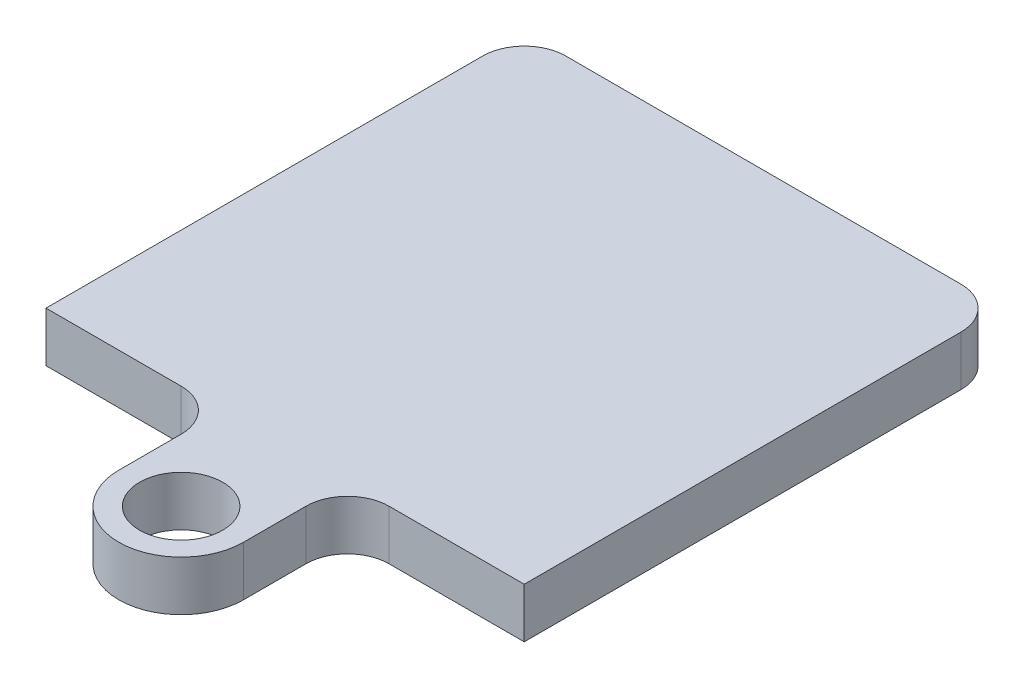
ISO-10303-21;
HEADER;
FILE_DESCRIPTION(('STEP AP214'),'2;1');
FILE_NAME('part.step','',(''),(''),'','','');
FILE_SCHEMA(('AUTOMOTIVE_DESIGN { 1 0 10303 214 1 1 1 1 }'));
ENDSEC;
DATA;
#1=APPLICATION_CONTEXT('core data for automotive mechanical design processes');
#2=APPLICATION_PROTOCOL_DEFINITION('international standard','automotive_design',2000,#1);
#3=PRODUCT_CONTEXT('',#1,'mechanical');
#4=PRODUCT('Part','Part','',(#3));
#5=PRODUCT_RELATED_PRODUCT_CATEGORY('part','',(#4));
#6=PRODUCT_DEFINITION_FORMATION('','',#4);
#7=PRODUCT_DEFINITION_CONTEXT('part definition',#1,'design');
#8=PRODUCT_DEFINITION('design','',#6,#7);
#9=PRODUCT_DEFINITION_SHAPE('','',#8);
#10=(LENGTH_UNIT() NAMED_UNIT(*) SI_UNIT(.MILLI.,.METRE.));
#11=(NAMED_UNIT(*) PLANE_ANGLE_UNIT() SI_UNIT($,.RADIAN.));
#12=(NAMED_UNIT(*) SI_UNIT($,.STERADIAN.) SOLID_ANGLE_UNIT());
#13=UNCERTAINTY_MEASURE_WITH_UNIT(LENGTH_MEASURE(1.E-05),#10,'distance_accuracy_value','');
#14=(GEOMETRIC_REPRESENTATION_CONTEXT(3) GLOBAL_UNCERTAINTY_ASSIGNED_CONTEXT((#13)) GLOBAL_UNIT_ASSIGNED_CONTEXT((#10,
#11,#12)) REPRESENTATION_CONTEXT('',''));
#15=CARTESIAN_POINT('',(0.,0.,0.));
#16=DIRECTION('',(0.,0.,1.));
#17=DIRECTION('',(1.,0.,0.));
#18=AXIS2_PLACEMENT_3D('',#15,#16,#17);
#19=CARTESIAN_POINT('',(-11.5,2.4,11.5));
#20=DIRECTION('',(0.,0.,-1.));
#21=DIRECTION('',(-1.,0.,0.));
#22=AXIS2_PLACEMENT_3D('',#19,#20,#21);
#23=PLANE('',#22);
#24=DIRECTION('',(1.,0.,0.));
#25=VECTOR('',#24,1.);
#26=CARTESIAN_POINT('',(-11.5,2.4,11.5));
#27=LINE('',#26,#25);
#28=CARTESIAN_POINT('',(5.,2.4,11.5));
#29=VERTEX_POINT('',#28);
#30=CARTESIAN_POINT('',(11.5,2.4,11.5));
#31=VERTEX_POINT('',#30);
#32=EDGE_CURVE('E157',#29,#31,#27,.T.);
#33=ORIENTED_EDGE('',*,*,#32,.F.);
#34=DIRECTION('',(0.,1.,0.));
#35=VECTOR('',#34,1.);
#36=CARTESIAN_POINT('',(5.,2.4,11.5));
#37=LINE('',#36,#35);
#38=CARTESIAN_POINT('',(5.,0.,11.5));
#39=VERTEX_POINT('',#38);
#40=EDGE_CURVE('E203',#29,#39,#37,.F.);
#41=ORIENTED_EDGE('',*,*,#40,.T.);
#42=DIRECTION('',(1.,0.,0.));
#43=VECTOR('',#42,1.);
#44=CARTESIAN_POINT('',(-11.5,0.,11.5));
#45=LINE('',#44,#43);
#46=CARTESIAN_POINT('',(11.5,0.,11.5));
#47=VERTEX_POINT('',#46);
#48=EDGE_CURVE('E168',#39,#47,#45,.T.);
#49=ORIENTED_EDGE('',*,*,#48,.T.);
#50=DIRECTION('',(0.,-1.,0.));
#51=VECTOR('',#50,1.);
#52=CARTESIAN_POINT('',(11.5,2.4,11.5));
#53=LINE('',#52,#51);
#54=EDGE_CURVE('E166',#31,#47,#53,.T.);
#55=ORIENTED_EDGE('',*,*,#54,.F.);
#56=EDGE_LOOP('',(#33,#41,#49,#55));
#57=FACE_BOUND('',#56,.T.);
#58=ADVANCED_FACE('F37',(#57),#23,.F.);
#59=CARTESIAN_POINT('',(-11.5,2.4,-11.5));
#60=DIRECTION('',(1.,0.,0.));
#61=DIRECTION('',(0.,0.,-1.));
#62=AXIS2_PLACEMENT_3D('',#59,#60,#61);
#63=PLANE('',#62);
#64=DIRECTION('',(0.,0.,1.));
#65=VECTOR('',#64,1.);
#66=CARTESIAN_POINT('',(-11.5,2.4,-11.5));
#67=LINE('',#66,#65);
#68=CARTESIAN_POINT('',(-11.5,2.4,-9.5));
#69=VERTEX_POINT('',#68);
#70=CARTESIAN_POINT('',(-11.5,2.4,11.5));
#71=VERTEX_POINT('',#70);
#72=EDGE_CURVE('E155',#69,#71,#67,.T.);
#73=ORIENTED_EDGE('',*,*,#72,.F.);
#74=DIRECTION('',(0.,-1.,0.));
#75=VECTOR('',#74,1.);
#76=CARTESIAN_POINT('',(-11.5,2.4,-9.5));
#77=LINE('',#76,#75);
#78=CARTESIAN_POINT('',(-11.5,0.,-9.5));
#79=VERTEX_POINT('',#78);
#80=EDGE_CURVE('E182',#69,#79,#77,.T.);
#81=ORIENTED_EDGE('',*,*,#80,.T.);
#82=DIRECTION('',(0.,0.,1.));
#83=VECTOR('',#82,1.);
#84=CARTESIAN_POINT('',(-11.5,0.,-11.5));
#85=LINE('',#84,#83);
#86=CARTESIAN_POINT('',(-11.5,0.,11.5));
#87=VERTEX_POINT('',#86);
#88=EDGE_CURVE('E154',#79,#87,#85,.T.);
#89=ORIENTED_EDGE('',*,*,#88,.T.);
#90=DIRECTION('',(0.,-1.,0.));
#91=VECTOR('',#90,1.);
#92=CARTESIAN_POINT('',(-11.5,2.4,11.5));
#93=LINE('',#92,#91);
#94=EDGE_CURVE('E179',#71,#87,#93,.T.);
#95=ORIENTED_EDGE('',*,*,#94,.F.);
#96=EDGE_LOOP('',(#73,#81,#89,#95));
#97=FACE_BOUND('',#96,.T.);
#98=ADVANCED_FACE('F251',(#97),#63,.F.);
#99=CARTESIAN_POINT('',(-5.,0.,11.5));
#100=VERTEX_POINT('',#99);
#101=EDGE_CURVE('E169',#87,#100,#45,.T.);
#102=ORIENTED_EDGE('',*,*,#101,.T.);
#103=DIRECTION('',(0.,1.,0.));
#104=VECTOR('',#103,1.);
#105=CARTESIAN_POINT('',(-5.,2.4,11.5));
#106=LINE('',#105,#104);
#107=CARTESIAN_POINT('',(-5.,2.4,11.5));
#108=VERTEX_POINT('',#107);
#109=EDGE_CURVE('E205',#100,#108,#106,.T.);
#110=ORIENTED_EDGE('',*,*,#109,.T.);
#111=EDGE_CURVE('E159',#71,#108,#27,.T.);
#112=ORIENTED_EDGE('',*,*,#111,.F.);
#113=ORIENTED_EDGE('',*,*,#94,.T.);
#114=EDGE_LOOP('',(#102,#110,#112,#113));
#115=FACE_BOUND('',#114,.T.);
#116=ADVANCED_FACE('F255',(#115),#23,.F.);
#117=CARTESIAN_POINT('',(11.5,2.4,-11.5));
#118=DIRECTION('',(-1.,0.,0.));
#119=DIRECTION('',(0.,0.,1.));
#120=AXIS2_PLACEMENT_3D('',#117,#118,#119);
#121=PLANE('',#120);
#122=DIRECTION('',(0.,0.,-1.));
#123=VECTOR('',#122,1.);
#124=CARTESIAN_POINT('',(11.5,0.,-11.5));
#125=LINE('',#124,#123);
#126=CARTESIAN_POINT('',(11.5,0.,-9.5));
#127=VERTEX_POINT('',#126);
#128=EDGE_CURVE('E172',#47,#127,#125,.T.);
#129=ORIENTED_EDGE('',*,*,#128,.T.);
#130=DIRECTION('',(0.,-1.,0.));
#131=VECTOR('',#130,1.);
#132=CARTESIAN_POINT('',(11.5,2.4,-9.5));
#133=LINE('',#132,#131);
#134=CARTESIAN_POINT('',(11.5,2.4,-9.5));
#135=VERTEX_POINT('',#134);
#136=EDGE_CURVE('E198',#127,#135,#133,.F.);
#137=ORIENTED_EDGE('',*,*,#136,.T.);
#138=DIRECTION('',(0.,0.,-1.));
#139=VECTOR('',#138,1.);
#140=CARTESIAN_POINT('',(11.5,2.4,-11.5));
#141=LINE('',#140,#139);
#142=EDGE_CURVE('E161',#31,#135,#141,.T.);
#143=ORIENTED_EDGE('',*,*,#142,.F.);
#144=ORIENTED_EDGE('',*,*,#54,.T.);
#145=EDGE_LOOP('',(#129,#137,#143,#144));
#146=FACE_BOUND('',#145,.T.);
#147=ADVANCED_FACE('F233',(#146),#121,.F.);
#148=CARTESIAN_POINT('',(-11.5,2.4,-11.5));
#149=DIRECTION('',(0.,0.,1.));
#150=DIRECTION('',(1.,0.,0.));
#151=AXIS2_PLACEMENT_3D('',#148,#149,#150);
#152=PLANE('',#151);
#153=DIRECTION('',(-1.,0.,0.));
#154=VECTOR('',#153,1.);
#155=CARTESIAN_POINT('',(-11.5,0.,-11.5));
#156=LINE('',#155,#154);
#157=CARTESIAN_POINT('',(9.5,0.,-11.5));
#158=VERTEX_POINT('',#157);
#159=CARTESIAN_POINT('',(-9.5,0.,-11.5));
#160=VERTEX_POINT('',#159);
#161=EDGE_CURVE('E158',#158,#160,#156,.T.);
#162=ORIENTED_EDGE('',*,*,#161,.T.);
#163=DIRECTION('',(0.,-1.,0.));
#164=VECTOR('',#163,1.);
#165=CARTESIAN_POINT('',(-9.5,2.4,-11.5));
#166=LINE('',#165,#164);
#167=CARTESIAN_POINT('',(-9.5,2.4,-11.5));
#168=VERTEX_POINT('',#167);
#169=EDGE_CURVE('E192',#160,#168,#166,.F.);
#170=ORIENTED_EDGE('',*,*,#169,.T.);
#171=DIRECTION('',(-1.,0.,0.));
#172=VECTOR('',#171,1.);
#173=CARTESIAN_POINT('',(-11.5,2.4,-11.5));
#174=LINE('',#173,#172);
#175=CARTESIAN_POINT('',(9.5,2.4,-11.5));
#176=VERTEX_POINT('',#175);
#177=EDGE_CURVE('E164',#176,#168,#174,.T.);
#178=ORIENTED_EDGE('',*,*,#177,.F.);
#179=DIRECTION('',(0.,-1.,0.));
#180=VECTOR('',#179,1.);
#181=CARTESIAN_POINT('',(9.5,2.4,-11.5));
#182=LINE('',#181,#180);
#183=EDGE_CURVE('E189',#176,#158,#182,.T.);
#184=ORIENTED_EDGE('',*,*,#183,.T.);
#185=EDGE_LOOP('',(#162,#170,#178,#184));
#186=FACE_BOUND('',#185,.T.);
#187=ADVANCED_FACE('F242',(#186),#152,.F.);
#188=CARTESIAN_POINT('',(0.,2.4,0.));
#189=DIRECTION('',(0.,1.,0.));
#190=DIRECTION('',(0.,0.,1.));
#191=AXIS2_PLACEMENT_3D('',#188,#189,#190);
#192=PLANE('',#191);
#193=ORIENTED_EDGE('',*,*,#177,.T.);
#194=CARTESIAN_POINT('',(-9.5,2.4,-9.5));
#195=DIRECTION('',(0.,1.,0.));
#196=DIRECTION('',(0.,0.,1.));
#197=AXIS2_PLACEMENT_3D('',#194,#195,#196);
#198=CIRCLE('',#197,2.);
#199=EDGE_CURVE('E196',#168,#69,#198,.T.);
#200=ORIENTED_EDGE('',*,*,#199,.T.);
#201=ORIENTED_EDGE('',*,*,#72,.T.);
#202=ORIENTED_EDGE('',*,*,#111,.T.);
#203=CARTESIAN_POINT('',(-5.,2.4,13.5));
#204=DIRECTION('',(0.,1.,0.));
#205=DIRECTION('',(0.,0.,1.));
#206=AXIS2_PLACEMENT_3D('',#203,#204,#205);
#207=CIRCLE('',#206,2.);
#208=CARTESIAN_POINT('',(-3.,2.4,13.5));
#209=VERTEX_POINT('',#208);
#210=EDGE_CURVE('E45',#108,#209,#207,.F.);
#211=ORIENTED_EDGE('',*,*,#210,.T.);
#212=DIRECTION('',(0.,0.,1.));
#213=VECTOR('',#212,1.);
#214=CARTESIAN_POINT('',(-3.,2.4,11.5));
#215=LINE('',#214,#213);
#216=CARTESIAN_POINT('',(-3.,2.4,16.5));
#217=VERTEX_POINT('',#216);
#218=EDGE_CURVE('E123',#209,#217,#215,.T.);
#219=ORIENTED_EDGE('',*,*,#218,.T.);
#220=CARTESIAN_POINT('',(0.,2.4,16.5));
#221=DIRECTION('',(0.,1.,0.));
#222=DIRECTION('',(0.,0.,1.));
#223=AXIS2_PLACEMENT_3D('',#220,#221,#222);
#224=CIRCLE('',#223,3.);
#225=CARTESIAN_POINT('',(3.,2.4,16.5));
#226=VERTEX_POINT('',#225);
#227=EDGE_CURVE('E130',#217,#226,#224,.T.);
#228=ORIENTED_EDGE('',*,*,#227,.T.);
#229=DIRECTION('',(0.,0.,-1.));
#230=VECTOR('',#229,1.);
#231=CARTESIAN_POINT('',(3.,2.4,16.5));
#232=LINE('',#231,#230);
#233=CARTESIAN_POINT('',(3.,2.4,13.5));
#234=VERTEX_POINT('',#233);
#235=EDGE_CURVE('E141',#226,#234,#232,.T.);
#236=ORIENTED_EDGE('',*,*,#235,.T.);
#237=CARTESIAN_POINT('',(5.,2.4,13.5));
#238=DIRECTION('',(0.,1.,0.));
#239=DIRECTION('',(0.,0.,1.));
#240=AXIS2_PLACEMENT_3D('',#237,#238,#239);
#241=CIRCLE('',#240,2.);
#242=EDGE_CURVE('E209',#234,#29,#241,.F.);
#243=ORIENTED_EDGE('',*,*,#242,.T.);
#244=ORIENTED_EDGE('',*,*,#32,.T.);
#245=ORIENTED_EDGE('',*,*,#142,.T.);
#246=CARTESIAN_POINT('',(9.5,2.4,-9.5));
#247=DIRECTION('',(0.,1.,0.));
#248=DIRECTION('',(0.,0.,1.));
#249=AXIS2_PLACEMENT_3D('',#246,#247,#248);
#250=CIRCLE('',#249,2.);
#251=EDGE_CURVE('E194',#135,#176,#250,.T.);
#252=ORIENTED_EDGE('',*,*,#251,.T.);
#253=EDGE_LOOP('',(#193,#200,#201,#202,#211,#219,#228,#236,#243,#244,#245,#252));
#254=FACE_BOUND('',#253,.T.);
#255=CARTESIAN_POINT('',(0.,2.4,16.5));
#256=DIRECTION('',(0.,1.,0.));
#257=DIRECTION('',(0.,0.,1.));
#258=AXIS2_PLACEMENT_3D('',#255,#256,#257);
#259=CIRCLE('',#258,2.);
#260=CARTESIAN_POINT('',(0.,2.4,18.5));
#261=VERTEX_POINT('',#260);
#262=EDGE_CURVE('E132',#261,#261,#259,.T.);
#263=ORIENTED_EDGE('',*,*,#262,.F.);
#264=EDGE_LOOP('',(#263));
#265=FACE_BOUND('',#264,.T.);
#266=ADVANCED_FACE('F126',(#254,#265),#192,.T.);
#267=CARTESIAN_POINT('',(0.,0.,0.));
#268=DIRECTION('',(0.,1.,0.));
#269=DIRECTION('',(0.,0.,1.));
#270=AXIS2_PLACEMENT_3D('',#267,#268,#269);
#271=PLANE('',#270);
#272=ORIENTED_EDGE('',*,*,#88,.F.);
#273=CARTESIAN_POINT('',(-9.5,0.,-9.5));
#274=DIRECTION('',(0.,1.,0.));
#275=DIRECTION('',(0.,0.,1.));
#276=AXIS2_PLACEMENT_3D('',#273,#274,#275);
#277=CIRCLE('',#276,2.);
#278=EDGE_CURVE('E187',#79,#160,#277,.F.);
#279=ORIENTED_EDGE('',*,*,#278,.T.);
#280=ORIENTED_EDGE('',*,*,#161,.F.);
#281=CARTESIAN_POINT('',(9.5,0.,-9.5));
#282=DIRECTION('',(0.,1.,0.));
#283=DIRECTION('',(0.,0.,1.));
#284=AXIS2_PLACEMENT_3D('',#281,#282,#283);
#285=CIRCLE('',#284,2.);
#286=EDGE_CURVE('E185',#158,#127,#285,.F.);
#287=ORIENTED_EDGE('',*,*,#286,.T.);
#288=ORIENTED_EDGE('',*,*,#128,.F.);
#289=ORIENTED_EDGE('',*,*,#48,.F.);
#290=CARTESIAN_POINT('',(5.,0.,13.5));
#291=DIRECTION('',(0.,1.,0.));
#292=DIRECTION('',(0.,0.,1.));
#293=AXIS2_PLACEMENT_3D('',#290,#291,#292);
#294=CIRCLE('',#293,2.);
#295=CARTESIAN_POINT('',(3.,0.,13.5));
#296=VERTEX_POINT('',#295);
#297=EDGE_CURVE('E211',#39,#296,#294,.T.);
#298=ORIENTED_EDGE('',*,*,#297,.T.);
#299=DIRECTION('',(0.,0.,1.));
#300=VECTOR('',#299,1.);
#301=CARTESIAN_POINT('',(3.,0.,16.5));
#302=LINE('',#301,#300);
#303=CARTESIAN_POINT('',(3.,0.,16.5));
#304=VERTEX_POINT('',#303);
#305=EDGE_CURVE('E219',#296,#304,#302,.T.);
#306=ORIENTED_EDGE('',*,*,#305,.T.);
#307=CARTESIAN_POINT('',(0.,0.,16.5));
#308=DIRECTION('',(0.,1.,0.));
#309=DIRECTION('',(0.,0.,1.));
#310=AXIS2_PLACEMENT_3D('',#307,#308,#309);
#311=CIRCLE('',#310,3.);
#312=CARTESIAN_POINT('',(-3.,0.,16.5));
#313=VERTEX_POINT('',#312);
#314=EDGE_CURVE('E149',#304,#313,#311,.F.);
#315=ORIENTED_EDGE('',*,*,#314,.T.);
#316=DIRECTION('',(0.,0.,-1.));
#317=VECTOR('',#316,1.);
#318=CARTESIAN_POINT('',(-3.,0.,11.5));
#319=LINE('',#318,#317);
#320=CARTESIAN_POINT('',(-3.,0.,13.5));
#321=VERTEX_POINT('',#320);
#322=EDGE_CURVE('E137',#313,#321,#319,.T.);
#323=ORIENTED_EDGE('',*,*,#322,.T.);
#324=CARTESIAN_POINT('',(-5.,0.,13.5));
#325=DIRECTION('',(0.,1.,0.));
#326=DIRECTION('',(0.,0.,1.));
#327=AXIS2_PLACEMENT_3D('',#324,#325,#326);
#328=CIRCLE('',#327,2.);
#329=EDGE_CURVE('E11',#321,#100,#328,.T.);
#330=ORIENTED_EDGE('',*,*,#329,.T.);
#331=ORIENTED_EDGE('',*,*,#101,.F.);
#332=EDGE_LOOP('',(#272,#279,#280,#287,#288,#289,#298,#306,#315,#323,#330,#331));
#333=FACE_BOUND('',#332,.T.);
#334=CARTESIAN_POINT('',(0.,0.,16.5));
#335=DIRECTION('',(0.,1.,0.));
#336=DIRECTION('',(0.,0.,1.));
#337=AXIS2_PLACEMENT_3D('',#334,#335,#336);
#338=CIRCLE('',#337,2.);
#339=CARTESIAN_POINT('',(0.,0.,18.5));
#340=VERTEX_POINT('',#339);
#341=EDGE_CURVE('E151',#340,#340,#338,.F.);
#342=ORIENTED_EDGE('',*,*,#341,.F.);
#343=EDGE_LOOP('',(#342));
#344=FACE_BOUND('',#343,.T.);
#345=ADVANCED_FACE('F217',(#333,#344),#271,.F.);
#346=CARTESIAN_POINT('',(-9.5,2.4,-9.5));
#347=DIRECTION('',(0.,-1.,0.));
#348=DIRECTION('',(0.,0.,-1.));
#349=AXIS2_PLACEMENT_3D('',#346,#347,#348);
#350=CYLINDRICAL_SURFACE('',#349,2.);
#351=ORIENTED_EDGE('',*,*,#199,.F.);
#352=ORIENTED_EDGE('',*,*,#169,.F.);
#353=ORIENTED_EDGE('',*,*,#278,.F.);
#354=ORIENTED_EDGE('',*,*,#80,.F.);
#355=EDGE_LOOP('',(#351,#352,#353,#354));
#356=FACE_BOUND('',#355,.T.);
#357=ADVANCED_FACE('F248',(#356),#350,.T.);
#358=CARTESIAN_POINT('',(9.5,2.4,-9.5));
#359=DIRECTION('',(0.,-1.,0.));
#360=DIRECTION('',(0.,0.,-1.));
#361=AXIS2_PLACEMENT_3D('',#358,#359,#360);
#362=CYLINDRICAL_SURFACE('',#361,2.);
#363=ORIENTED_EDGE('',*,*,#251,.F.);
#364=ORIENTED_EDGE('',*,*,#136,.F.);
#365=ORIENTED_EDGE('',*,*,#286,.F.);
#366=ORIENTED_EDGE('',*,*,#183,.F.);
#367=EDGE_LOOP('',(#363,#364,#365,#366));
#368=FACE_BOUND('',#367,.T.);
#369=ADVANCED_FACE('F239',(#368),#362,.T.);
#370=CARTESIAN_POINT('',(-3.,-10.,11.5));
#371=DIRECTION('',(-1.,0.,0.));
#372=DIRECTION('',(0.,0.,1.));
#373=AXIS2_PLACEMENT_3D('',#370,#371,#372);
#374=PLANE('',#373);
#375=ORIENTED_EDGE('',*,*,#218,.F.);
#376=DIRECTION('',(0.,1.,0.));
#377=VECTOR('',#376,1.);
#378=CARTESIAN_POINT('',(-3.,-10.,13.5));
#379=LINE('',#378,#377);
#380=EDGE_CURVE('E58',#209,#321,#379,.F.);
#381=ORIENTED_EDGE('',*,*,#380,.T.);
#382=ORIENTED_EDGE('',*,*,#322,.F.);
#383=DIRECTION('',(0.,1.,0.));
#384=VECTOR('',#383,1.);
#385=CARTESIAN_POINT('',(-3.,-10.,16.5));
#386=LINE('',#385,#384);
#387=EDGE_CURVE('E135',#313,#217,#386,.T.);
#388=ORIENTED_EDGE('',*,*,#387,.T.);
#389=EDGE_LOOP('',(#375,#381,#382,#388));
#390=FACE_BOUND('',#389,.T.);
#391=ADVANCED_FACE('F136',(#390),#374,.T.);
#392=CARTESIAN_POINT('',(0.,-10.,16.5));
#393=DIRECTION('',(0.,1.,0.));
#394=DIRECTION('',(0.,0.,1.));
#395=AXIS2_PLACEMENT_3D('',#392,#393,#394);
#396=CYLINDRICAL_SURFACE('',#395,3.);
#397=ORIENTED_EDGE('',*,*,#314,.F.);
#398=DIRECTION('',(0.,1.,0.));
#399=VECTOR('',#398,1.);
#400=CARTESIAN_POINT('',(3.,-10.,16.5));
#401=LINE('',#400,#399);
#402=EDGE_CURVE('E140',#304,#226,#401,.T.);
#403=ORIENTED_EDGE('',*,*,#402,.T.);
#404=ORIENTED_EDGE('',*,*,#227,.F.);
#405=ORIENTED_EDGE('',*,*,#387,.F.);
#406=EDGE_LOOP('',(#397,#403,#404,#405));
#407=FACE_BOUND('',#406,.T.);
#408=ADVANCED_FACE('F143',(#407),#396,.T.);
#409=CARTESIAN_POINT('',(3.,-10.,16.5));
#410=DIRECTION('',(1.,0.,0.));
#411=DIRECTION('',(0.,0.,-1.));
#412=AXIS2_PLACEMENT_3D('',#409,#410,#411);
#413=PLANE('',#412);
#414=ORIENTED_EDGE('',*,*,#305,.F.);
#415=DIRECTION('',(0.,1.,0.));
#416=VECTOR('',#415,1.);
#417=CARTESIAN_POINT('',(3.,-10.,13.5));
#418=LINE('',#417,#416);
#419=EDGE_CURVE('E200',#296,#234,#418,.T.);
#420=ORIENTED_EDGE('',*,*,#419,.T.);
#421=ORIENTED_EDGE('',*,*,#235,.F.);
#422=ORIENTED_EDGE('',*,*,#402,.F.);
#423=EDGE_LOOP('',(#414,#420,#421,#422));
#424=FACE_BOUND('',#423,.T.);
#425=ADVANCED_FACE('F225',(#424),#413,.T.);
#426=CARTESIAN_POINT('',(0.,-10.,16.5));
#427=DIRECTION('',(0.,1.,0.));
#428=DIRECTION('',(0.,0.,1.));
#429=AXIS2_PLACEMENT_3D('',#426,#427,#428);
#430=CYLINDRICAL_SURFACE('',#429,2.);
#431=ORIENTED_EDGE('',*,*,#341,.T.);
#432=EDGE_LOOP('',(#431));
#433=FACE_BOUND('',#432,.T.);
#434=ORIENTED_EDGE('',*,*,#262,.T.);
#435=EDGE_LOOP('',(#434));
#436=FACE_BOUND('',#435,.T.);
#437=ADVANCED_FACE('F264',(#433,#436),#430,.F.);
#438=CARTESIAN_POINT('',(5.,-10.,13.5));
#439=DIRECTION('',(0.,1.,0.));
#440=DIRECTION('',(0.,0.,1.));
#441=AXIS2_PLACEMENT_3D('',#438,#439,#440);
#442=CYLINDRICAL_SURFACE('',#441,2.);
#443=ORIENTED_EDGE('',*,*,#297,.F.);
#444=ORIENTED_EDGE('',*,*,#40,.F.);
#445=ORIENTED_EDGE('',*,*,#242,.F.);
#446=ORIENTED_EDGE('',*,*,#419,.F.);
#447=EDGE_LOOP('',(#443,#444,#445,#446));
#448=FACE_BOUND('',#447,.T.);
#449=ADVANCED_FACE('F227',(#448),#442,.F.);
#450=CARTESIAN_POINT('',(-5.,2.4,13.5));
#451=DIRECTION('',(0.,1.,0.));
#452=DIRECTION('',(0.,0.,1.));
#453=AXIS2_PLACEMENT_3D('',#450,#451,#452);
#454=CYLINDRICAL_SURFACE('',#453,2.);
#455=ORIENTED_EDGE('',*,*,#329,.F.);
#456=ORIENTED_EDGE('',*,*,#380,.F.);
#457=ORIENTED_EDGE('',*,*,#210,.F.);
#458=ORIENTED_EDGE('',*,*,#109,.F.);
#459=EDGE_LOOP('',(#455,#456,#457,#458));
#460=FACE_BOUND('',#459,.T.);
#461=ADVANCED_FACE('F39',(#460),#454,.F.);
#462=CLOSED_SHELL('',(#58,#98,#116,#147,#187,#266,#345,#357,#369,#391,#408,#425,#437,#449,#461));
#463=MANIFOLD_SOLID_BREP('B2',#462);
#464=ADVANCED_BREP_SHAPE_REPRESENTATION('',(#18,#463),#14);
#465=SHAPE_DEFINITION_REPRESENTATION(#9,#464);
ENDSEC;
END-ISO-10303-21;
